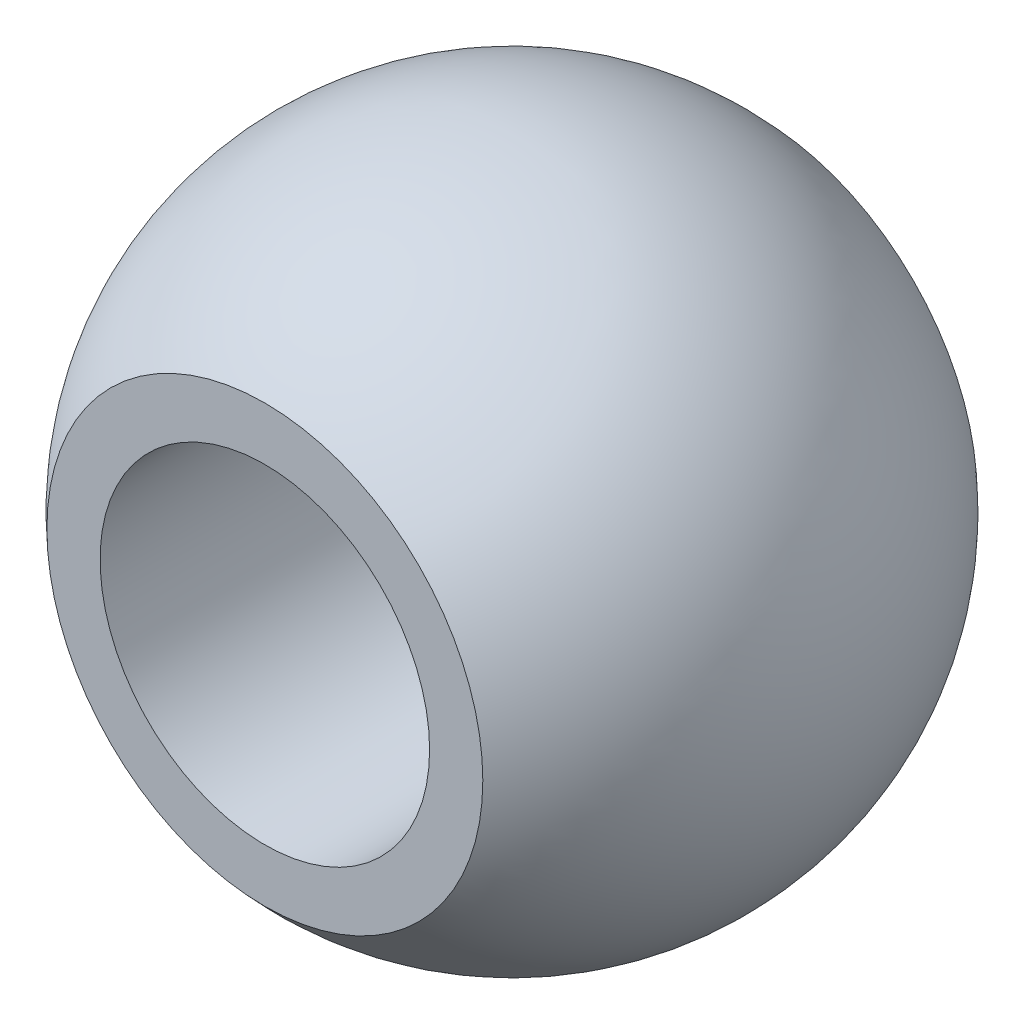
ISO-10303-21;
HEADER;
FILE_DESCRIPTION(('STEP AP214'),'2;1');
FILE_NAME('part.step','',(''),(''),'','','');
FILE_SCHEMA(('AUTOMOTIVE_DESIGN { 1 0 10303 214 1 1 1 1 }'));
ENDSEC;
DATA;
#1=APPLICATION_CONTEXT('core data for automotive mechanical design processes');
#2=APPLICATION_PROTOCOL_DEFINITION('international standard','automotive_design',2000,#1);
#3=PRODUCT_CONTEXT('',#1,'mechanical');
#4=PRODUCT('Part','Part','',(#3));
#5=PRODUCT_RELATED_PRODUCT_CATEGORY('part','',(#4));
#6=PRODUCT_DEFINITION_FORMATION('','',#4);
#7=PRODUCT_DEFINITION_CONTEXT('part definition',#1,'design');
#8=PRODUCT_DEFINITION('design','',#6,#7);
#9=PRODUCT_DEFINITION_SHAPE('','',#8);
#10=(LENGTH_UNIT() NAMED_UNIT(*) SI_UNIT(.MILLI.,.METRE.));
#11=(NAMED_UNIT(*) PLANE_ANGLE_UNIT() SI_UNIT($,.RADIAN.));
#12=(NAMED_UNIT(*) SI_UNIT($,.STERADIAN.) SOLID_ANGLE_UNIT());
#13=UNCERTAINTY_MEASURE_WITH_UNIT(LENGTH_MEASURE(1.E-05),#10,'distance_accuracy_value','');
#14=(GEOMETRIC_REPRESENTATION_CONTEXT(3) GLOBAL_UNCERTAINTY_ASSIGNED_CONTEXT((#13)) GLOBAL_UNIT_ASSIGNED_CONTEXT((#10,
#11,#12)) REPRESENTATION_CONTEXT('',''));
#15=CARTESIAN_POINT('',(0.,0.,0.));
#16=DIRECTION('',(0.,0.,1.));
#17=DIRECTION('',(1.,0.,0.));
#18=AXIS2_PLACEMENT_3D('',#15,#16,#17);
#19=CARTESIAN_POINT('',(-5.29150262212918,0.,-6.));
#20=DIRECTION('',(0.,0.,-1.));
#21=DIRECTION('',(-1.,0.,0.));
#22=AXIS2_PLACEMENT_3D('',#19,#20,#21);
#23=PLANE('',#22);
#24=CARTESIAN_POINT('',(0.,0.,-6.));
#25=DIRECTION('',(0.,0.,-1.));
#26=DIRECTION('',(-1.,0.,0.));
#27=AXIS2_PLACEMENT_3D('',#24,#25,#26);
#28=CIRCLE('',#27,4.);
#29=CARTESIAN_POINT('',(-4.,0.,-6.));
#30=VERTEX_POINT('',#29);
#31=EDGE_CURVE('E43',#30,#30,#28,.T.);
#32=ORIENTED_EDGE('',*,*,#31,.F.);
#33=EDGE_LOOP('',(#32));
#34=FACE_BOUND('',#33,.T.);
#35=CARTESIAN_POINT('',(0.,0.,-6.));
#36=DIRECTION('',(0.,0.,-1.));
#37=DIRECTION('',(-1.,0.,0.));
#38=AXIS2_PLACEMENT_3D('',#35,#36,#37);
#39=CIRCLE('',#38,5.29150262212918);
#40=CARTESIAN_POINT('',(-5.29150262212918,0.,-6.));
#41=VERTEX_POINT('',#40);
#42=EDGE_CURVE('E10',#41,#41,#39,.T.);
#43=ORIENTED_EDGE('',*,*,#42,.T.);
#44=EDGE_LOOP('',(#43));
#45=FACE_BOUND('',#44,.T.);
#46=ADVANCED_FACE('F33',(#34,#45),#23,.T.);
#47=CARTESIAN_POINT('',(0.,0.,0.));
#48=DIRECTION('',(0.,0.,-1.));
#49=DIRECTION('',(-1.,0.,0.));
#50=AXIS2_PLACEMENT_3D('',#47,#48,#49);
#51=SPHERICAL_SURFACE('',#50,8.);
#52=CARTESIAN_POINT('',(0.,0.,6.));
#53=DIRECTION('',(0.,0.,-1.));
#54=DIRECTION('',(-1.,0.,0.));
#55=AXIS2_PLACEMENT_3D('',#52,#53,#54);
#56=CIRCLE('',#55,5.29150262212918);
#57=CARTESIAN_POINT('',(-5.29150262212918,0.,6.));
#58=VERTEX_POINT('',#57);
#59=EDGE_CURVE('E39',#58,#58,#56,.T.);
#60=ORIENTED_EDGE('',*,*,#59,.T.);
#61=EDGE_LOOP('',(#60));
#62=FACE_BOUND('',#61,.T.);
#63=ORIENTED_EDGE('',*,*,#42,.F.);
#64=EDGE_LOOP('',(#63));
#65=FACE_BOUND('',#64,.T.);
#66=ADVANCED_FACE('F58',(#62,#65),#51,.T.);
#67=CARTESIAN_POINT('',(-5.29150262212918,0.,6.));
#68=DIRECTION('',(0.,0.,1.));
#69=DIRECTION('',(1.,0.,0.));
#70=AXIS2_PLACEMENT_3D('',#67,#68,#69);
#71=PLANE('',#70);
#72=CARTESIAN_POINT('',(0.,0.,6.));
#73=DIRECTION('',(0.,0.,1.));
#74=DIRECTION('',(1.,0.,0.));
#75=AXIS2_PLACEMENT_3D('',#72,#73,#74);
#76=CIRCLE('',#75,4.);
#77=CARTESIAN_POINT('',(4.,0.,6.));
#78=VERTEX_POINT('',#77);
#79=EDGE_CURVE('E47',#78,#78,#76,.T.);
#80=ORIENTED_EDGE('',*,*,#79,.F.);
#81=EDGE_LOOP('',(#80));
#82=FACE_BOUND('',#81,.T.);
#83=ORIENTED_EDGE('',*,*,#59,.F.);
#84=EDGE_LOOP('',(#83));
#85=FACE_BOUND('',#84,.T.);
#86=ADVANCED_FACE('F55',(#82,#85),#71,.T.);
#87=CARTESIAN_POINT('',(0.,0.,-11.));
#88=DIRECTION('',(0.,0.,1.));
#89=DIRECTION('',(1.,0.,0.));
#90=AXIS2_PLACEMENT_3D('',#87,#88,#89);
#91=CYLINDRICAL_SURFACE('',#90,4.);
#92=ORIENTED_EDGE('',*,*,#31,.T.);
#93=EDGE_LOOP('',(#92));
#94=FACE_BOUND('',#93,.T.);
#95=ORIENTED_EDGE('',*,*,#79,.T.);
#96=EDGE_LOOP('',(#95));
#97=FACE_BOUND('',#96,.T.);
#98=ADVANCED_FACE('F53',(#94,#97),#91,.F.);
#99=CLOSED_SHELL('',(#46,#66,#86,#98));
#100=MANIFOLD_SOLID_BREP('B2',#99);
#101=ADVANCED_BREP_SHAPE_REPRESENTATION('',(#18,#100),#14);
#102=SHAPE_DEFINITION_REPRESENTATION(#9,#101);
ENDSEC;
END-ISO-10303-21;
